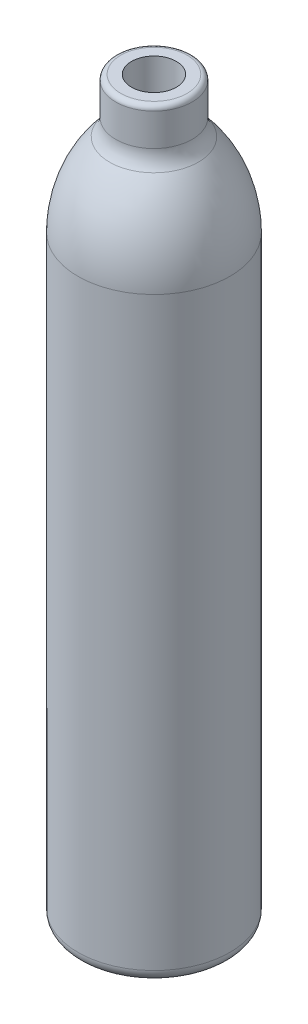
ISO-10303-21;
HEADER;
FILE_DESCRIPTION(('STEP AP214'),'2;1');
FILE_NAME('part.step','',(''),(''),'','','');
FILE_SCHEMA(('AUTOMOTIVE_DESIGN { 1 0 10303 214 1 1 1 1 }'));
ENDSEC;
DATA;
#1=APPLICATION_CONTEXT('core data for automotive mechanical design processes');
#2=APPLICATION_PROTOCOL_DEFINITION('international standard','automotive_design',2000,#1);
#3=PRODUCT_CONTEXT('',#1,'mechanical');
#4=PRODUCT('Part','Part','',(#3));
#5=PRODUCT_RELATED_PRODUCT_CATEGORY('part','',(#4));
#6=PRODUCT_DEFINITION_FORMATION('','',#4);
#7=PRODUCT_DEFINITION_CONTEXT('part definition',#1,'design');
#8=PRODUCT_DEFINITION('design','',#6,#7);
#9=PRODUCT_DEFINITION_SHAPE('','',#8);
#10=(LENGTH_UNIT() NAMED_UNIT(*) SI_UNIT(.MILLI.,.METRE.));
#11=(NAMED_UNIT(*) PLANE_ANGLE_UNIT() SI_UNIT($,.RADIAN.));
#12=(NAMED_UNIT(*) SI_UNIT($,.STERADIAN.) SOLID_ANGLE_UNIT());
#13=UNCERTAINTY_MEASURE_WITH_UNIT(LENGTH_MEASURE(1.E-05),#10,'distance_accuracy_value','');
#14=(GEOMETRIC_REPRESENTATION_CONTEXT(3) GLOBAL_UNCERTAINTY_ASSIGNED_CONTEXT((#13)) GLOBAL_UNIT_ASSIGNED_CONTEXT((#10,
#11,#12)) REPRESENTATION_CONTEXT('',''));
#15=CARTESIAN_POINT('',(0.,0.,0.));
#16=DIRECTION('',(0.,0.,1.));
#17=DIRECTION('',(1.,0.,0.));
#18=AXIS2_PLACEMENT_3D('',#15,#16,#17);
#19=CARTESIAN_POINT('',(13.3,129.302861252312,0.));
#20=DIRECTION('',(0.,-1.,0.));
#21=DIRECTION('',(1.,0.,0.));
#22=AXIS2_PLACEMENT_3D('',#19,#20,#21);
#23=PLANE('',#22);
#24=CARTESIAN_POINT('',(0.,129.302861252312,0.));
#25=DIRECTION('',(0.,-1.,0.));
#26=DIRECTION('',(1.,0.,0.));
#27=AXIS2_PLACEMENT_3D('',#24,#25,#26);
#28=CIRCLE('',#27,9.);
#29=CARTESIAN_POINT('',(9.,129.302861252312,0.));
#30=VERTEX_POINT('',#29);
#31=EDGE_CURVE('E61',#30,#30,#28,.F.);
#32=ORIENTED_EDGE('',*,*,#31,.F.);
#33=EDGE_LOOP('',(#32));
#34=FACE_BOUND('',#33,.T.);
#35=CARTESIAN_POINT('',(0.,129.302861252312,0.));
#36=DIRECTION('',(0.,1.,0.));
#37=DIRECTION('',(-1.,0.,0.));
#38=AXIS2_PLACEMENT_3D('',#35,#36,#37);
#39=CIRCLE('',#38,13.3);
#40=CARTESIAN_POINT('',(-13.3,129.302861252312,0.));
#41=VERTEX_POINT('',#40);
#42=EDGE_CURVE('E10',#41,#41,#39,.T.);
#43=ORIENTED_EDGE('',*,*,#42,.T.);
#44=EDGE_LOOP('',(#43));
#45=FACE_BOUND('',#44,.T.);
#46=ADVANCED_FACE('F33',(#34,#45),#23,.F.);
#47=CARTESIAN_POINT('',(0.,127.302861252312,0.));
#48=DIRECTION('',(0.,1.,0.));
#49=DIRECTION('',(-1.,0.,0.));
#50=AXIS2_PLACEMENT_3D('',#47,#48,#49);
#51=TOROIDAL_SURFACE('',#50,13.3,2.);
#52=ORIENTED_EDGE('',*,*,#42,.F.);
#53=EDGE_LOOP('',(#52));
#54=FACE_BOUND('',#53,.T.);
#55=CARTESIAN_POINT('',(0.,127.302861252312,0.));
#56=DIRECTION('',(0.,1.,0.));
#57=DIRECTION('',(-1.,0.,0.));
#58=AXIS2_PLACEMENT_3D('',#55,#56,#57);
#59=CIRCLE('',#58,15.3);
#60=CARTESIAN_POINT('',(-15.3,127.302861252312,0.));
#61=VERTEX_POINT('',#60);
#62=EDGE_CURVE('E39',#61,#61,#59,.T.);
#63=ORIENTED_EDGE('',*,*,#62,.T.);
#64=EDGE_LOOP('',(#63));
#65=FACE_BOUND('',#64,.T.);
#66=ADVANCED_FACE('F95',(#54,#65),#51,.T.);
#67=CARTESIAN_POINT('',(0.,129.302861252312,0.));
#68=DIRECTION('',(0.,1.,0.));
#69=DIRECTION('',(-1.,0.,0.));
#70=AXIS2_PLACEMENT_3D('',#67,#68,#69);
#71=CYLINDRICAL_SURFACE('',#70,15.3);
#72=ORIENTED_EDGE('',*,*,#62,.F.);
#73=EDGE_LOOP('',(#72));
#74=FACE_BOUND('',#73,.T.);
#75=CARTESIAN_POINT('',(0.,114.302861252312,0.));
#76=DIRECTION('',(0.,1.,0.));
#77=DIRECTION('',(-1.,0.,0.));
#78=AXIS2_PLACEMENT_3D('',#75,#76,#77);
#79=CIRCLE('',#78,15.3);
#80=CARTESIAN_POINT('',(-15.3,114.302861252312,0.));
#81=VERTEX_POINT('',#80);
#82=EDGE_CURVE('E43',#81,#81,#79,.T.);
#83=ORIENTED_EDGE('',*,*,#82,.T.);
#84=EDGE_LOOP('',(#83));
#85=FACE_BOUND('',#84,.T.);
#86=ADVANCED_FACE('F100',(#74,#85),#71,.T.);
#87=CARTESIAN_POINT('',(0.,114.302861252312,0.));
#88=DIRECTION('',(0.,1.,0.));
#89=DIRECTION('',(-1.,0.,0.));
#90=AXIS2_PLACEMENT_3D('',#87,#88,#89);
#91=TOROIDAL_SURFACE('',#90,25.3,9.99999999999999);
#92=ORIENTED_EDGE('',*,*,#82,.F.);
#93=EDGE_LOOP('',(#92));
#94=FACE_BOUND('',#93,.T.);
#95=CARTESIAN_POINT('',(0.,107.661826649027,0.));
#96=DIRECTION('',(0.,1.,0.));
#97=DIRECTION('',(-1.,0.,0.));
#98=AXIS2_PLACEMENT_3D('',#95,#96,#97);
#99=CIRCLE('',#98,17.8235931492485);
#100=CARTESIAN_POINT('',(-17.8235931492485,107.661826649027,0.));
#101=VERTEX_POINT('',#100);
#102=EDGE_CURVE('E47',#101,#101,#99,.T.);
#103=ORIENTED_EDGE('',*,*,#102,.T.);
#104=EDGE_LOOP('',(#103));
#105=FACE_BOUND('',#104,.T.);
#106=ADVANCED_FACE('F106',(#94,#105),#91,.F.);
#107=CARTESIAN_POINT('',(0.,74.3028612523125,0.));
#108=DIRECTION('',(0.,1.,0.));
#109=DIRECTION('',(-1.,0.,0.));
#110=AXIS2_PLACEMENT_3D('',#107,#108,#109);
#111=DEGENERATE_TOROIDAL_SURFACE('',#110,19.7315789473684,50.2315789473684,.F.);
#112=ORIENTED_EDGE('',*,*,#102,.F.);
#113=EDGE_LOOP('',(#112));
#114=FACE_BOUND('',#113,.T.);
#115=CARTESIAN_POINT('',(0.,74.3028612523125,0.));
#116=DIRECTION('',(0.,1.,0.));
#117=DIRECTION('',(-1.,0.,0.));
#118=AXIS2_PLACEMENT_3D('',#115,#116,#117);
#119=CIRCLE('',#118,30.5);
#120=CARTESIAN_POINT('',(-30.5,74.3028612523125,0.));
#121=VERTEX_POINT('',#120);
#122=EDGE_CURVE('E52',#121,#121,#119,.T.);
#123=ORIENTED_EDGE('',*,*,#122,.T.);
#124=EDGE_LOOP('',(#123));
#125=FACE_BOUND('',#124,.T.);
#126=ADVANCED_FACE('F112',(#114,#125),#111,.F.);
#127=CARTESIAN_POINT('',(0.,129.302861252312,0.));
#128=DIRECTION('',(0.,1.,0.));
#129=DIRECTION('',(-1.,0.,0.));
#130=AXIS2_PLACEMENT_3D('',#127,#128,#129);
#131=CYLINDRICAL_SURFACE('',#130,30.5);
#132=ORIENTED_EDGE('',*,*,#122,.F.);
#133=EDGE_LOOP('',(#132));
#134=FACE_BOUND('',#133,.T.);
#135=CARTESIAN_POINT('',(0.,-160.697138747687,0.));
#136=DIRECTION('',(0.,1.,0.));
#137=DIRECTION('',(-1.,0.,0.));
#138=AXIS2_PLACEMENT_3D('',#135,#136,#137);
#139=CIRCLE('',#138,30.5);
#140=CARTESIAN_POINT('',(-30.5,-160.697138747687,0.));
#141=VERTEX_POINT('',#140);
#142=EDGE_CURVE('E55',#141,#141,#139,.T.);
#143=ORIENTED_EDGE('',*,*,#142,.T.);
#144=EDGE_LOOP('',(#143));
#145=FACE_BOUND('',#144,.T.);
#146=ADVANCED_FACE('F116',(#134,#145),#131,.T.);
#147=CARTESIAN_POINT('',(0.,-160.697138747688,0.));
#148=DIRECTION('',(0.,1.,0.));
#149=DIRECTION('',(-1.,0.,0.));
#150=AXIS2_PLACEMENT_3D('',#147,#148,#149);
#151=TOROIDAL_SURFACE('',#150,25.5,5.);
#152=ORIENTED_EDGE('',*,*,#142,.F.);
#153=EDGE_LOOP('',(#152));
#154=FACE_BOUND('',#153,.T.);
#155=CARTESIAN_POINT('',(0.,-165.697138747688,0.));
#156=DIRECTION('',(0.,1.,0.));
#157=DIRECTION('',(-1.,0.,0.));
#158=AXIS2_PLACEMENT_3D('',#155,#156,#157);
#159=CIRCLE('',#158,25.5);
#160=CARTESIAN_POINT('',(-25.4999999999999,-165.697138747688,0.));
#161=VERTEX_POINT('',#160);
#162=EDGE_CURVE('E58',#161,#161,#159,.T.);
#163=ORIENTED_EDGE('',*,*,#162,.T.);
#164=EDGE_LOOP('',(#163));
#165=FACE_BOUND('',#164,.T.);
#166=ADVANCED_FACE('F91',(#154,#165),#151,.T.);
#167=CARTESIAN_POINT('',(25.5,-165.697138747688,0.));
#168=DIRECTION('',(0.,1.,0.));
#169=DIRECTION('',(-1.,0.,0.));
#170=AXIS2_PLACEMENT_3D('',#167,#168,#169);
#171=PLANE('',#170);
#172=ORIENTED_EDGE('',*,*,#162,.F.);
#173=EDGE_LOOP('',(#172));
#174=FACE_BOUND('',#173,.T.);
#175=ADVANCED_FACE('F82',(#174),#171,.F.);
#176=CARTESIAN_POINT('',(0.,129.302861252312,0.));
#177=DIRECTION('',(0.,1.,0.));
#178=DIRECTION('',(-1.,0.,0.));
#179=AXIS2_PLACEMENT_3D('',#176,#177,#178);
#180=CYLINDRICAL_SURFACE('',#179,9.);
#181=ORIENTED_EDGE('',*,*,#31,.T.);
#182=EDGE_LOOP('',(#181));
#183=FACE_BOUND('',#182,.T.);
#184=CARTESIAN_POINT('',(0.,114.302861252312,0.));
#185=DIRECTION('',(0.,1.,0.));
#186=DIRECTION('',(-1.,0.,0.));
#187=AXIS2_PLACEMENT_3D('',#184,#185,#186);
#188=CIRCLE('',#187,9.);
#189=CARTESIAN_POINT('',(-8.99999999999999,114.302861252312,0.));
#190=VERTEX_POINT('',#189);
#191=EDGE_CURVE('E64',#190,#190,#188,.T.);
#192=ORIENTED_EDGE('',*,*,#191,.F.);
#193=EDGE_LOOP('',(#192));
#194=FACE_BOUND('',#193,.T.);
#195=ADVANCED_FACE('F80',(#183,#194),#180,.F.);
#196=CARTESIAN_POINT('',(0.,114.302861252312,0.));
#197=DIRECTION('',(0.,1.,0.));
#198=DIRECTION('',(-1.,0.,0.));
#199=AXIS2_PLACEMENT_3D('',#196,#197,#198);
#200=TOROIDAL_SURFACE('',#199,25.3,16.3);
#201=ORIENTED_EDGE('',*,*,#191,.T.);
#202=EDGE_LOOP('',(#201));
#203=FACE_BOUND('',#202,.T.);
#204=CARTESIAN_POINT('',(0.,103.477974848957,0.));
#205=DIRECTION('',(0.,1.,0.));
#206=DIRECTION('',(-1.,0.,0.));
#207=AXIS2_PLACEMENT_3D('',#204,#205,#206);
#208=CIRCLE('',#207,13.1134568332751);
#209=CARTESIAN_POINT('',(-13.1134568332751,103.477974848957,0.));
#210=VERTEX_POINT('',#209);
#211=EDGE_CURVE('E71',#210,#210,#208,.T.);
#212=ORIENTED_EDGE('',*,*,#211,.F.);
#213=EDGE_LOOP('',(#212));
#214=FACE_BOUND('',#213,.T.);
#215=ADVANCED_FACE('F77',(#203,#214),#200,.T.);
#216=CARTESIAN_POINT('',(0.,74.3028612523125,0.));
#217=DIRECTION('',(0.,1.,0.));
#218=DIRECTION('',(-1.,0.,0.));
#219=AXIS2_PLACEMENT_3D('',#216,#217,#218);
#220=DEGENERATE_TOROIDAL_SURFACE('',#219,19.7315789473684,43.9315789473684,.F.);
#221=ORIENTED_EDGE('',*,*,#211,.T.);
#222=EDGE_LOOP('',(#221));
#223=FACE_BOUND('',#222,.T.);
#224=CARTESIAN_POINT('',(0.,74.3028612523125,0.));
#225=DIRECTION('',(0.,1.,0.));
#226=DIRECTION('',(-1.,0.,0.));
#227=AXIS2_PLACEMENT_3D('',#224,#225,#226);
#228=CIRCLE('',#227,24.2);
#229=CARTESIAN_POINT('',(-24.2,74.3028612523125,0.));
#230=VERTEX_POINT('',#229);
#231=EDGE_CURVE('E68',#230,#230,#228,.T.);
#232=ORIENTED_EDGE('',*,*,#231,.F.);
#233=EDGE_LOOP('',(#232));
#234=FACE_BOUND('',#233,.T.);
#235=ADVANCED_FACE('F89',(#223,#234),#220,.T.);
#236=CARTESIAN_POINT('',(0.,129.302861252312,0.));
#237=DIRECTION('',(0.,1.,0.));
#238=DIRECTION('',(-1.,0.,0.));
#239=AXIS2_PLACEMENT_3D('',#236,#237,#238);
#240=CYLINDRICAL_SURFACE('',#239,24.2);
#241=ORIENTED_EDGE('',*,*,#231,.T.);
#242=EDGE_LOOP('',(#241));
#243=FACE_BOUND('',#242,.T.);
#244=CARTESIAN_POINT('',(0.,-159.397138747687,0.));
#245=DIRECTION('',(0.,1.,0.));
#246=DIRECTION('',(-1.,0.,0.));
#247=AXIS2_PLACEMENT_3D('',#244,#245,#246);
#248=CIRCLE('',#247,24.2);
#249=CARTESIAN_POINT('',(-24.2,-159.397138747687,0.));
#250=VERTEX_POINT('',#249);
#251=EDGE_CURVE('E65',#250,#250,#248,.T.);
#252=ORIENTED_EDGE('',*,*,#251,.F.);
#253=EDGE_LOOP('',(#252));
#254=FACE_BOUND('',#253,.T.);
#255=ADVANCED_FACE('F127',(#243,#254),#240,.F.);
#256=CARTESIAN_POINT('',(25.5,-159.397138747688,0.));
#257=DIRECTION('',(0.,1.,0.));
#258=DIRECTION('',(-1.,0.,0.));
#259=AXIS2_PLACEMENT_3D('',#256,#257,#258);
#260=PLANE('',#259);
#261=ORIENTED_EDGE('',*,*,#251,.T.);
#262=EDGE_LOOP('',(#261));
#263=FACE_BOUND('',#262,.T.);
#264=ADVANCED_FACE('F124',(#263),#260,.T.);
#265=CLOSED_SHELL('',(#46,#66,#86,#106,#126,#146,#166,#175,#195,#215,#235,#255,#264));
#266=MANIFOLD_SOLID_BREP('B2',#265);
#267=ADVANCED_BREP_SHAPE_REPRESENTATION('',(#18,#266),#14);
#268=SHAPE_DEFINITION_REPRESENTATION(#9,#267);
ENDSEC;
END-ISO-10303-21;
